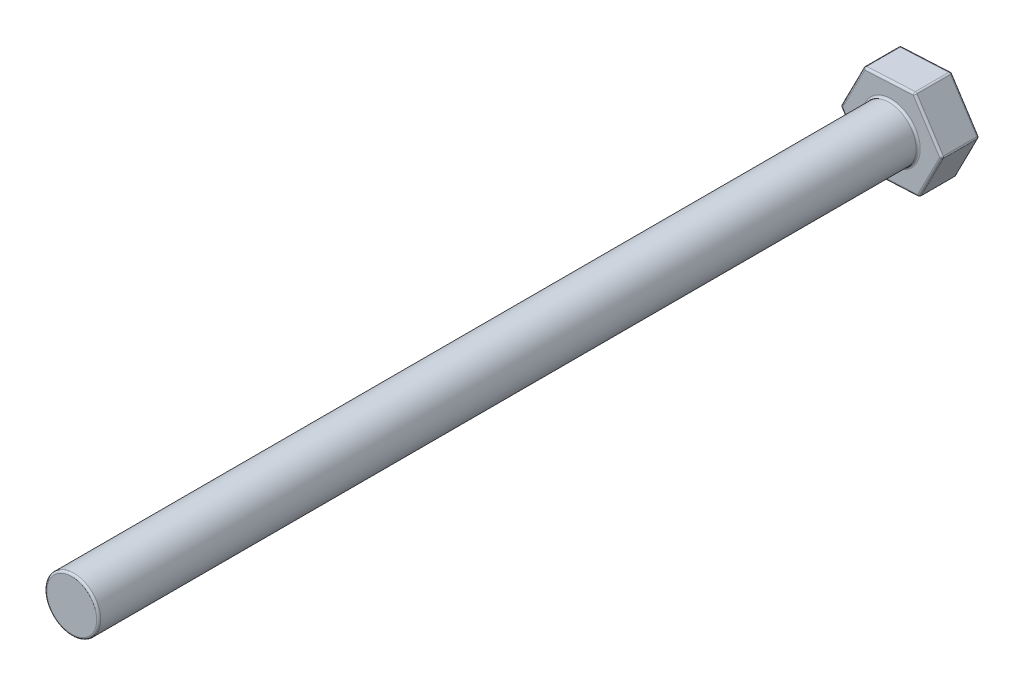
ISO-10303-21;
HEADER;
FILE_DESCRIPTION(('STEP AP214'),'2;1');
FILE_NAME('part.step','',(''),(''),'','','');
FILE_SCHEMA(('AUTOMOTIVE_DESIGN { 1 0 10303 214 1 1 1 1 }'));
ENDSEC;
DATA;
#1=APPLICATION_CONTEXT('core data for automotive mechanical design processes');
#2=APPLICATION_PROTOCOL_DEFINITION('international standard','automotive_design',2000,#1);
#3=PRODUCT_CONTEXT('',#1,'mechanical');
#4=PRODUCT('Part','Part','',(#3));
#5=PRODUCT_RELATED_PRODUCT_CATEGORY('part','',(#4));
#6=PRODUCT_DEFINITION_FORMATION('','',#4);
#7=PRODUCT_DEFINITION_CONTEXT('part definition',#1,'design');
#8=PRODUCT_DEFINITION('design','',#6,#7);
#9=PRODUCT_DEFINITION_SHAPE('','',#8);
#10=(LENGTH_UNIT() NAMED_UNIT(*) SI_UNIT(.MILLI.,.METRE.));
#11=(NAMED_UNIT(*) PLANE_ANGLE_UNIT() SI_UNIT($,.RADIAN.));
#12=(NAMED_UNIT(*) SI_UNIT($,.STERADIAN.) SOLID_ANGLE_UNIT());
#13=UNCERTAINTY_MEASURE_WITH_UNIT(LENGTH_MEASURE(1.E-05),#10,'distance_accuracy_value','');
#14=(GEOMETRIC_REPRESENTATION_CONTEXT(3) GLOBAL_UNCERTAINTY_ASSIGNED_CONTEXT((#13)) GLOBAL_UNIT_ASSIGNED_CONTEXT((#10,
#11,#12)) REPRESENTATION_CONTEXT('',''));
#15=CARTESIAN_POINT('',(0.,0.,0.));
#16=DIRECTION('',(0.,0.,1.));
#17=DIRECTION('',(1.,0.,0.));
#18=AXIS2_PLACEMENT_3D('',#15,#16,#17);
#19=CARTESIAN_POINT('',(0.,0.,120.));
#20=DIRECTION('',(0.,0.,-1.));
#21=DIRECTION('',(-1.,0.,0.));
#22=AXIS2_PLACEMENT_3D('',#19,#20,#21);
#23=CYLINDRICAL_SURFACE('',#22,3.95);
#24=CARTESIAN_POINT('',(0.,0.,0.299999999999995));
#25=DIRECTION('',(0.,0.,-1.));
#26=DIRECTION('',(-1.,0.,0.));
#27=AXIS2_PLACEMENT_3D('',#24,#25,#26);
#28=CIRCLE('',#27,3.95);
#29=CARTESIAN_POINT('',(-3.95,0.,0.299999999999995));
#30=VERTEX_POINT('',#29);
#31=EDGE_CURVE('E44',#30,#30,#28,.F.);
#32=ORIENTED_EDGE('',*,*,#31,.T.);
#33=EDGE_LOOP('',(#32));
#34=FACE_BOUND('',#33,.T.);
#35=CARTESIAN_POINT('',(0.,0.,119.7));
#36=DIRECTION('',(0.,0.,1.));
#37=DIRECTION('',(1.,0.,0.));
#38=AXIS2_PLACEMENT_3D('',#35,#36,#37);
#39=CIRCLE('',#38,3.95);
#40=CARTESIAN_POINT('',(3.95,0.,119.7));
#41=VERTEX_POINT('',#40);
#42=EDGE_CURVE('E273',#41,#41,#39,.F.);
#43=ORIENTED_EDGE('',*,*,#42,.T.);
#44=EDGE_LOOP('',(#43));
#45=FACE_BOUND('',#44,.T.);
#46=ADVANCED_FACE('F35',(#34,#45),#23,.T.);
#47=CARTESIAN_POINT('',(0.,0.,120.));
#48=DIRECTION('',(0.,0.,1.));
#49=DIRECTION('',(1.,0.,0.));
#50=AXIS2_PLACEMENT_3D('',#47,#48,#49);
#51=PLANE('',#50);
#52=CARTESIAN_POINT('',(0.,0.,120.));
#53=DIRECTION('',(0.,0.,1.));
#54=DIRECTION('',(1.,0.,0.));
#55=AXIS2_PLACEMENT_3D('',#52,#53,#54);
#56=CIRCLE('',#55,3.65);
#57=CARTESIAN_POINT('',(3.65,0.,120.));
#58=VERTEX_POINT('',#57);
#59=EDGE_CURVE('E11',#58,#58,#56,.T.);
#60=ORIENTED_EDGE('',*,*,#59,.T.);
#61=EDGE_LOOP('',(#60));
#62=FACE_BOUND('',#61,.T.);
#63=ADVANCED_FACE('F470',(#62),#51,.T.);
#64=CARTESIAN_POINT('',(3.39564795055581,6.62869330983763,-5.5));
#65=DIRECTION('',(-0.839851839228609,-0.542815703664073,0.));
#66=DIRECTION('',(0.542815703664073,-0.839851839228609,0.));
#67=AXIS2_PLACEMENT_3D('',#64,#65,#66);
#68=PLANE('',#67);
#69=DIRECTION('',(0.,0.,1.));
#70=VECTOR('',#69,1.);
#71=CARTESIAN_POINT('',(3.48966638834505,6.48322670420022,-5.5));
#72=LINE('',#71,#70);
#73=CARTESIAN_POINT('',(3.48966638834505,6.48322670420022,-5.2));
#74=VERTEX_POINT('',#73);
#75=CARTESIAN_POINT('',(3.48966638834505,6.48322670420022,-0.3));
#76=VERTEX_POINT('',#75);
#77=EDGE_CURVE('E224',#74,#76,#72,.T.);
#78=ORIENTED_EDGE('',*,*,#77,.T.);
#79=DIRECTION('',(0.542815703664073,-0.839851839228609,0.));
#80=VECTOR('',#79,1.);
#81=CARTESIAN_POINT('',(3.39564795055581,6.62869330983763,-0.3));
#82=LINE('',#81,#80);
#83=CARTESIAN_POINT('',(7.344422337704,0.519095873066327,-0.3));
#84=VERTEX_POINT('',#83);
#85=EDGE_CURVE('E229',#76,#84,#82,.T.);
#86=ORIENTED_EDGE('',*,*,#85,.T.);
#87=DIRECTION('',(0.,0.,1.));
#88=VECTOR('',#87,1.);
#89=CARTESIAN_POINT('',(7.344422337704,0.519095873066327,-5.5));
#90=LINE('',#89,#88);
#91=CARTESIAN_POINT('',(7.344422337704,0.519095873066327,-5.2));
#92=VERTEX_POINT('',#91);
#93=EDGE_CURVE('E226',#84,#92,#90,.F.);
#94=ORIENTED_EDGE('',*,*,#93,.T.);
#95=DIRECTION('',(0.542815703664073,-0.839851839228609,0.));
#96=VECTOR('',#95,1.);
#97=CARTESIAN_POINT('',(3.39564795055581,6.62869330983763,-5.2));
#98=LINE('',#97,#96);
#99=EDGE_CURVE('E222',#92,#74,#98,.F.);
#100=ORIENTED_EDGE('',*,*,#99,.T.);
#101=EDGE_LOOP('',(#78,#86,#94,#100));
#102=FACE_BOUND('',#101,.T.);
#103=ADVANCED_FACE('F388',(#102),#68,.F.);
#104=CARTESIAN_POINT('',(7.43844077549324,0.373629267428915,-5.5));
#105=DIRECTION('',(-0.890018108560518,0.455925176355023,0.));
#106=DIRECTION('',(-0.455925176355023,-0.890018108560518,0.));
#107=AXIS2_PLACEMENT_3D('',#104,#105,#106);
#108=PLANE('',#107);
#109=DIRECTION('',(0.,0.,1.));
#110=VECTOR('',#109,1.);
#111=CARTESIAN_POINT('',(7.35947221850357,0.219473609060598,-5.5));
#112=LINE('',#111,#110);
#113=CARTESIAN_POINT('',(7.35947221850357,0.219473609060598,-5.2));
#114=VERTEX_POINT('',#113);
#115=CARTESIAN_POINT('',(7.35947221850357,0.219473609060598,-0.3));
#116=VERTEX_POINT('',#115);
#117=EDGE_CURVE('E215',#114,#116,#112,.T.);
#118=ORIENTED_EDGE('',*,*,#117,.T.);
#119=DIRECTION('',(-0.455925176355023,-0.890018108560518,0.));
#120=VECTOR('',#119,1.);
#121=CARTESIAN_POINT('',(7.43844077549324,0.373629267428915,-0.3));
#122=LINE('',#121,#120);
#123=CARTESIAN_POINT('',(4.1217613819271,-6.10090838404039,-0.3));
#124=VERTEX_POINT('',#123);
#125=EDGE_CURVE('E220',#116,#124,#122,.T.);
#126=ORIENTED_EDGE('',*,*,#125,.T.);
#127=DIRECTION('',(0.,0.,1.));
#128=VECTOR('',#127,1.);
#129=CARTESIAN_POINT('',(4.1217613819271,-6.10090838404039,-5.5));
#130=LINE('',#129,#128);
#131=CARTESIAN_POINT('',(4.1217613819271,-6.10090838404039,-5.2));
#132=VERTEX_POINT('',#131);
#133=EDGE_CURVE('E217',#124,#132,#130,.F.);
#134=ORIENTED_EDGE('',*,*,#133,.T.);
#135=DIRECTION('',(-0.455925176355023,-0.890018108560518,0.));
#136=VECTOR('',#135,1.);
#137=CARTESIAN_POINT('',(7.43844077549324,0.373629267428915,-5.2));
#138=LINE('',#137,#136);
#139=EDGE_CURVE('E213',#132,#114,#138,.F.);
#140=ORIENTED_EDGE('',*,*,#139,.T.);
#141=EDGE_LOOP('',(#118,#126,#134,#140));
#142=FACE_BOUND('',#141,.T.);
#143=ADVANCED_FACE('F789',(#142),#108,.F.);
#144=CARTESIAN_POINT('',(4.04279282493743,-6.25506404240871,-5.5));
#145=DIRECTION('',(-0.0501662693319089,0.998740880019096,0.));
#146=DIRECTION('',(-0.998740880019096,-0.0501662693319089,0.));
#147=AXIS2_PLACEMENT_3D('',#144,#145,#146);
#148=PLANE('',#147);
#149=DIRECTION('',(0.,0.,1.));
#150=VECTOR('',#149,1.);
#151=CARTESIAN_POINT('',(3.86980583015852,-6.26375309513962,-5.5));
#152=LINE('',#151,#150);
#153=CARTESIAN_POINT('',(3.86980583015852,-6.26375309513962,-5.2));
#154=VERTEX_POINT('',#153);
#155=CARTESIAN_POINT('',(3.86980583015852,-6.26375309513962,-0.3));
#156=VERTEX_POINT('',#155);
#157=EDGE_CURVE('E206',#154,#156,#152,.T.);
#158=ORIENTED_EDGE('',*,*,#157,.T.);
#159=DIRECTION('',(-0.998740880019096,-0.0501662693319089,0.));
#160=VECTOR('',#159,1.);
#161=CARTESIAN_POINT('',(4.04279282493743,-6.25506404240871,-0.3));
#162=LINE('',#161,#160);
#163=CARTESIAN_POINT('',(-3.2226609557769,-6.62000425710672,-0.3));
#164=VERTEX_POINT('',#163);
#165=EDGE_CURVE('E211',#156,#164,#162,.T.);
#166=ORIENTED_EDGE('',*,*,#165,.T.);
#167=DIRECTION('',(0.,0.,1.));
#168=VECTOR('',#167,1.);
#169=CARTESIAN_POINT('',(-3.2226609557769,-6.62000425710672,-5.5));
#170=LINE('',#169,#168);
#171=CARTESIAN_POINT('',(-3.2226609557769,-6.62000425710672,-5.2));
#172=VERTEX_POINT('',#171);
#173=EDGE_CURVE('E208',#164,#172,#170,.F.);
#174=ORIENTED_EDGE('',*,*,#173,.T.);
#175=DIRECTION('',(-0.998740880019096,-0.0501662693319089,0.));
#176=VECTOR('',#175,1.);
#177=CARTESIAN_POINT('',(4.04279282493744,-6.25506404240871,-5.2));
#178=LINE('',#177,#176);
#179=EDGE_CURVE('E204',#172,#154,#178,.F.);
#180=ORIENTED_EDGE('',*,*,#179,.T.);
#181=EDGE_LOOP('',(#158,#166,#174,#180));
#182=FACE_BOUND('',#181,.T.);
#183=ADVANCED_FACE('F781',(#182),#148,.F.);
#184=CARTESIAN_POINT('',(-3.39564795055581,-6.62869330983763,-5.5));
#185=DIRECTION('',(0.839851839228609,0.542815703664073,0.));
#186=DIRECTION('',(-0.542815703664073,0.839851839228609,0.));
#187=AXIS2_PLACEMENT_3D('',#184,#185,#186);
#188=PLANE('',#187);
#189=DIRECTION('',(0.,0.,1.));
#190=VECTOR('',#189,1.);
#191=CARTESIAN_POINT('',(-3.48966638834505,-6.48322670420022,-5.5));
#192=LINE('',#191,#190);
#193=CARTESIAN_POINT('',(-3.48966638834505,-6.48322670420022,-5.2));
#194=VERTEX_POINT('',#193);
#195=CARTESIAN_POINT('',(-3.48966638834505,-6.48322670420022,-0.3));
#196=VERTEX_POINT('',#195);
#197=EDGE_CURVE('E172',#194,#196,#192,.T.);
#198=ORIENTED_EDGE('',*,*,#197,.T.);
#199=DIRECTION('',(-0.542815703664073,0.839851839228609,0.));
#200=VECTOR('',#199,1.);
#201=CARTESIAN_POINT('',(-3.39564795055581,-6.62869330983763,-0.3));
#202=LINE('',#201,#200);
#203=CARTESIAN_POINT('',(-7.344422337704,-0.519095873066328,-0.3));
#204=VERTEX_POINT('',#203);
#205=EDGE_CURVE('E168',#196,#204,#202,.T.);
#206=ORIENTED_EDGE('',*,*,#205,.T.);
#207=DIRECTION('',(0.,0.,1.));
#208=VECTOR('',#207,1.);
#209=CARTESIAN_POINT('',(-7.344422337704,-0.519095873066328,-5.5));
#210=LINE('',#209,#208);
#211=CARTESIAN_POINT('',(-7.344422337704,-0.519095873066328,-5.2));
#212=VERTEX_POINT('',#211);
#213=EDGE_CURVE('E160',#204,#212,#210,.F.);
#214=ORIENTED_EDGE('',*,*,#213,.T.);
#215=DIRECTION('',(-0.542815703664073,0.839851839228609,0.));
#216=VECTOR('',#215,1.);
#217=CARTESIAN_POINT('',(-3.39564795055581,-6.62869330983763,-5.2));
#218=LINE('',#217,#216);
#219=EDGE_CURVE('E165',#212,#194,#218,.F.);
#220=ORIENTED_EDGE('',*,*,#219,.T.);
#221=EDGE_LOOP('',(#198,#206,#214,#220));
#222=FACE_BOUND('',#221,.T.);
#223=ADVANCED_FACE('F163',(#222),#188,.F.);
#224=CARTESIAN_POINT('',(-7.43844077549324,-0.373629267428917,-5.5));
#225=DIRECTION('',(0.890018108560518,-0.455925176355023,0.));
#226=DIRECTION('',(0.455925176355023,0.890018108560518,0.));
#227=AXIS2_PLACEMENT_3D('',#224,#225,#226);
#228=PLANE('',#227);
#229=DIRECTION('',(0.,0.,1.));
#230=VECTOR('',#229,1.);
#231=CARTESIAN_POINT('',(-7.35947221850357,-0.219473609060599,-5.5));
#232=LINE('',#231,#230);
#233=CARTESIAN_POINT('',(-7.35947221850357,-0.2194736090606,-5.2));
#234=VERTEX_POINT('',#233);
#235=CARTESIAN_POINT('',(-7.35947221850357,-0.219473609060599,-0.3));
#236=VERTEX_POINT('',#235);
#237=EDGE_CURVE('E180',#234,#236,#232,.T.);
#238=ORIENTED_EDGE('',*,*,#237,.T.);
#239=DIRECTION('',(0.455925176355023,0.890018108560518,0.));
#240=VECTOR('',#239,1.);
#241=CARTESIAN_POINT('',(-7.43844077549324,-0.373629267428917,-0.3));
#242=LINE('',#241,#240);
#243=CARTESIAN_POINT('',(-4.1217613819271,6.10090838404039,-0.3));
#244=VERTEX_POINT('',#243);
#245=EDGE_CURVE('E245',#236,#244,#242,.T.);
#246=ORIENTED_EDGE('',*,*,#245,.T.);
#247=DIRECTION('',(0.,0.,1.));
#248=VECTOR('',#247,1.);
#249=CARTESIAN_POINT('',(-4.1217613819271,6.10090838404039,-5.5));
#250=LINE('',#249,#248);
#251=CARTESIAN_POINT('',(-4.1217613819271,6.10090838404039,-5.2));
#252=VERTEX_POINT('',#251);
#253=EDGE_CURVE('E242',#244,#252,#250,.F.);
#254=ORIENTED_EDGE('',*,*,#253,.T.);
#255=DIRECTION('',(0.455925176355023,0.890018108560518,0.));
#256=VECTOR('',#255,1.);
#257=CARTESIAN_POINT('',(-7.43844077549324,-0.373629267428917,-5.2));
#258=LINE('',#257,#256);
#259=EDGE_CURVE('E240',#252,#234,#258,.F.);
#260=ORIENTED_EDGE('',*,*,#259,.T.);
#261=EDGE_LOOP('',(#238,#246,#254,#260));
#262=FACE_BOUND('',#261,.T.);
#263=ADVANCED_FACE('F447',(#262),#228,.F.);
#264=CARTESIAN_POINT('',(-4.04279282493743,6.25506404240871,-5.5));
#265=DIRECTION('',(0.0501662693319089,-0.998740880019096,0.));
#266=DIRECTION('',(0.998740880019096,0.0501662693319089,0.));
#267=AXIS2_PLACEMENT_3D('',#264,#265,#266);
#268=PLANE('',#267);
#269=DIRECTION('',(0.,0.,1.));
#270=VECTOR('',#269,1.);
#271=CARTESIAN_POINT('',(-3.86980583015852,6.26375309513962,-5.5));
#272=LINE('',#271,#270);
#273=CARTESIAN_POINT('',(-3.86980583015852,6.26375309513962,-5.2));
#274=VERTEX_POINT('',#273);
#275=CARTESIAN_POINT('',(-3.86980583015852,6.26375309513962,-0.3));
#276=VERTEX_POINT('',#275);
#277=EDGE_CURVE('E233',#274,#276,#272,.T.);
#278=ORIENTED_EDGE('',*,*,#277,.T.);
#279=DIRECTION('',(0.998740880019096,0.0501662693319089,0.));
#280=VECTOR('',#279,1.);
#281=CARTESIAN_POINT('',(-4.04279282493743,6.25506404240871,-0.3));
#282=LINE('',#281,#280);
#283=CARTESIAN_POINT('',(3.2226609557769,6.62000425710672,-0.3));
#284=VERTEX_POINT('',#283);
#285=EDGE_CURVE('E238',#276,#284,#282,.T.);
#286=ORIENTED_EDGE('',*,*,#285,.T.);
#287=DIRECTION('',(0.,0.,1.));
#288=VECTOR('',#287,1.);
#289=CARTESIAN_POINT('',(3.2226609557769,6.62000425710672,-5.5));
#290=LINE('',#289,#288);
#291=CARTESIAN_POINT('',(3.2226609557769,6.62000425710672,-5.2));
#292=VERTEX_POINT('',#291);
#293=EDGE_CURVE('E235',#284,#292,#290,.F.);
#294=ORIENTED_EDGE('',*,*,#293,.T.);
#295=DIRECTION('',(0.998740880019096,0.0501662693319089,0.));
#296=VECTOR('',#295,1.);
#297=CARTESIAN_POINT('',(-4.04279282493744,6.25506404240871,-5.2));
#298=LINE('',#297,#296);
#299=EDGE_CURVE('E231',#292,#274,#298,.F.);
#300=ORIENTED_EDGE('',*,*,#299,.T.);
#301=EDGE_LOOP('',(#278,#286,#294,#300));
#302=FACE_BOUND('',#301,.T.);
#303=ADVANCED_FACE('F459',(#302),#268,.F.);
#304=CARTESIAN_POINT('',(0.,0.,-5.5));
#305=DIRECTION('',(0.,0.,-1.));
#306=DIRECTION('',(-1.,0.,0.));
#307=AXIS2_PLACEMENT_3D('',#304,#305,#306);
#308=PLANE('',#307);
#309=DIRECTION('',(0.455925176355023,0.890018108560518,0.));
#310=VECTOR('',#309,1.);
#311=CARTESIAN_POINT('',(-3.77578739236928,6.1182864895022,-5.5));
#312=LINE('',#311,#310);
#313=CARTESIAN_POINT('',(-7.09246678593542,-0.356251161967106,-5.5));
#314=VERTEX_POINT('',#313);
#315=CARTESIAN_POINT('',(-3.85475594935895,5.96413083113389,-5.5));
#316=VERTEX_POINT('',#315);
#317=EDGE_CURVE('E52',#314,#316,#312,.T.);
#318=ORIENTED_EDGE('',*,*,#317,.T.);
#319=DIRECTION('',(0.998740880019096,0.0501662693319089,0.));
#320=VECTOR('',#319,1.);
#321=CARTESIAN_POINT('',(3.41069783135538,6.3290710458319,-5.5));
#322=LINE('',#321,#320);
#323=CARTESIAN_POINT('',(3.23771083657647,6.32038199310099,-5.5));
#324=VERTEX_POINT('',#323);
#325=EDGE_CURVE('E271',#316,#324,#322,.T.);
#326=ORIENTED_EDGE('',*,*,#325,.T.);
#327=DIRECTION('',(0.542815703664073,-0.839851839228609,0.));
#328=VECTOR('',#327,1.);
#329=CARTESIAN_POINT('',(7.18648522372466,0.210784556329693,-5.5));
#330=LINE('',#329,#328);
#331=CARTESIAN_POINT('',(7.09246678593542,0.356251161967106,-5.5));
#332=VERTEX_POINT('',#331);
#333=EDGE_CURVE('E263',#324,#332,#330,.T.);
#334=ORIENTED_EDGE('',*,*,#333,.T.);
#335=DIRECTION('',(-0.455925176355023,-0.890018108560518,0.));
#336=VECTOR('',#335,1.);
#337=CARTESIAN_POINT('',(3.77578739236928,-6.11828648950221,-5.5));
#338=LINE('',#337,#336);
#339=CARTESIAN_POINT('',(3.85475594935895,-5.96413083113389,-5.5));
#340=VERTEX_POINT('',#339);
#341=EDGE_CURVE('E265',#332,#340,#338,.T.);
#342=ORIENTED_EDGE('',*,*,#341,.T.);
#343=DIRECTION('',(-0.998740880019096,-0.0501662693319089,0.));
#344=VECTOR('',#343,1.);
#345=CARTESIAN_POINT('',(-3.41069783135538,-6.3290710458319,-5.5));
#346=LINE('',#345,#344);
#347=CARTESIAN_POINT('',(-3.23771083657647,-6.32038199310099,-5.5));
#348=VERTEX_POINT('',#347);
#349=EDGE_CURVE('E267',#340,#348,#346,.T.);
#350=ORIENTED_EDGE('',*,*,#349,.T.);
#351=DIRECTION('',(-0.542815703664073,0.839851839228609,0.));
#352=VECTOR('',#351,1.);
#353=CARTESIAN_POINT('',(-7.18648522372466,-0.210784556329694,-5.5));
#354=LINE('',#353,#352);
#355=EDGE_CURVE('E57',#348,#314,#354,.T.);
#356=ORIENTED_EDGE('',*,*,#355,.T.);
#357=EDGE_LOOP('',(#318,#326,#334,#342,#350,#356));
#358=FACE_BOUND('',#357,.T.);
#359=ADVANCED_FACE('F410',(#358),#308,.T.);
#360=CARTESIAN_POINT('',(0.,0.,0.));
#361=DIRECTION('',(0.,0.,-1.));
#362=DIRECTION('',(-1.,0.,0.));
#363=AXIS2_PLACEMENT_3D('',#360,#361,#362);
#364=PLANE('',#363);
#365=DIRECTION('',(-0.998740880019096,-0.0501662693319089,0.));
#366=VECTOR('',#365,1.);
#367=CARTESIAN_POINT('',(0.30852255639124,-6.14225641211744,0.));
#368=LINE('',#367,#366);
#369=CARTESIAN_POINT('',(-3.23771083657647,-6.320381993101,0.));
#370=VERTEX_POINT('',#369);
#371=CARTESIAN_POINT('',(3.85475594935895,-5.96413083113389,0.));
#372=VERTEX_POINT('',#371);
#373=EDGE_CURVE('E258',#370,#372,#368,.F.);
#374=ORIENTED_EDGE('',*,*,#373,.T.);
#375=DIRECTION('',(-0.455925176355023,-0.890018108560518,0.));
#376=VECTOR('',#375,1.);
#377=CARTESIAN_POINT('',(5.47361136764718,-2.80393983458339,0.));
#378=LINE('',#377,#376);
#379=CARTESIAN_POINT('',(7.09246678593542,0.356251161967106,0.));
#380=VERTEX_POINT('',#379);
#381=EDGE_CURVE('E260',#372,#380,#378,.F.);
#382=ORIENTED_EDGE('',*,*,#381,.T.);
#383=DIRECTION('',(0.542815703664073,-0.839851839228609,0.));
#384=VECTOR('',#383,1.);
#385=CARTESIAN_POINT('',(5.16508881125594,3.33831657753405,0.));
#386=LINE('',#385,#384);
#387=CARTESIAN_POINT('',(3.23771083657647,6.320381993101,0.));
#388=VERTEX_POINT('',#387);
#389=EDGE_CURVE('E250',#380,#388,#386,.F.);
#390=ORIENTED_EDGE('',*,*,#389,.T.);
#391=DIRECTION('',(0.998740880019096,0.0501662693319089,0.));
#392=VECTOR('',#391,1.);
#393=CARTESIAN_POINT('',(-0.30852255639124,6.14225641211744,0.));
#394=LINE('',#393,#392);
#395=CARTESIAN_POINT('',(-3.85475594935895,5.96413083113389,0.));
#396=VERTEX_POINT('',#395);
#397=EDGE_CURVE('E252',#388,#396,#394,.F.);
#398=ORIENTED_EDGE('',*,*,#397,.T.);
#399=DIRECTION('',(0.455925176355023,0.890018108560518,0.));
#400=VECTOR('',#399,1.);
#401=CARTESIAN_POINT('',(-5.47361136764718,2.80393983458339,0.));
#402=LINE('',#401,#400);
#403=CARTESIAN_POINT('',(-7.09246678593542,-0.356251161967107,0.));
#404=VERTEX_POINT('',#403);
#405=EDGE_CURVE('E254',#396,#404,#402,.F.);
#406=ORIENTED_EDGE('',*,*,#405,.T.);
#407=DIRECTION('',(-0.542815703664073,0.839851839228609,0.));
#408=VECTOR('',#407,1.);
#409=CARTESIAN_POINT('',(-5.16508881125594,-3.33831657753405,0.));
#410=LINE('',#409,#408);
#411=EDGE_CURVE('E256',#404,#370,#410,.F.);
#412=ORIENTED_EDGE('',*,*,#411,.T.);
#413=EDGE_LOOP('',(#374,#382,#390,#398,#406,#412));
#414=FACE_BOUND('',#413,.T.);
#415=CARTESIAN_POINT('',(0.,0.,0.));
#416=DIRECTION('',(0.,0.,-1.));
#417=DIRECTION('',(-1.,0.,0.));
#418=AXIS2_PLACEMENT_3D('',#415,#416,#417);
#419=CIRCLE('',#418,4.25);
#420=CARTESIAN_POINT('',(-4.25,0.,0.));
#421=VERTEX_POINT('',#420);
#422=EDGE_CURVE('E247',#421,#421,#419,.T.);
#423=ORIENTED_EDGE('',*,*,#422,.T.);
#424=EDGE_LOOP('',(#423));
#425=FACE_BOUND('',#424,.T.);
#426=ADVANCED_FACE('F377',(#414,#425),#364,.F.);
#427=CARTESIAN_POINT('',(3.23771083657647,6.320381993101,-5.5));
#428=DIRECTION('',(0.,0.,1.));
#429=DIRECTION('',(1.,0.,0.));
#430=AXIS2_PLACEMENT_3D('',#427,#428,#429);
#431=CYLINDRICAL_SURFACE('',#430,0.3);
#432=CARTESIAN_POINT('',(3.23771083657647,6.320381993101,-5.2));
#433=DIRECTION('',(0.,0.,-1.));
#434=DIRECTION('',(-1.,0.,0.));
#435=AXIS2_PLACEMENT_3D('',#432,#433,#434);
#436=CIRCLE('',#435,0.3);
#437=EDGE_CURVE('E39',#292,#74,#436,.T.);
#438=ORIENTED_EDGE('',*,*,#437,.F.);
#439=ORIENTED_EDGE('',*,*,#293,.F.);
#440=CARTESIAN_POINT('',(3.23771083657647,6.320381993101,-0.3));
#441=DIRECTION('',(0.,0.,1.));
#442=DIRECTION('',(1.,0.,0.));
#443=AXIS2_PLACEMENT_3D('',#440,#441,#442);
#444=CIRCLE('',#443,0.3);
#445=EDGE_CURVE('E200',#76,#284,#444,.T.);
#446=ORIENTED_EDGE('',*,*,#445,.F.);
#447=ORIENTED_EDGE('',*,*,#77,.F.);
#448=EDGE_LOOP('',(#438,#439,#446,#447));
#449=FACE_BOUND('',#448,.T.);
#450=ADVANCED_FACE('F403',(#449),#431,.T.);
#451=CARTESIAN_POINT('',(3.23771083657647,6.320381993101,-5.2));
#452=DIRECTION('',(0.,0.,1.));
#453=DIRECTION('',(1.,0.,0.));
#454=AXIS2_PLACEMENT_3D('',#451,#452,#453);
#455=SPHERICAL_SURFACE('',#454,0.3);
#456=CARTESIAN_POINT('',(3.23771083657647,6.32038199310099,-5.2));
#457=DIRECTION('',(0.998740880019096,0.0501662693319115,0.));
#458=DIRECTION('',(-0.0501662693319116,0.998740880019096,0.));
#459=AXIS2_PLACEMENT_3D('',#456,#457,#458);
#460=CIRCLE('',#459,0.3);
#461=EDGE_CURVE('E354',#292,#324,#460,.F.);
#462=ORIENTED_EDGE('',*,*,#461,.F.);
#463=ORIENTED_EDGE('',*,*,#437,.T.);
#464=CARTESIAN_POINT('',(3.23771083657647,6.320381993101,-5.2));
#465=DIRECTION('',(-0.542815703664073,0.839851839228609,0.));
#466=DIRECTION('',(-0.839851839228609,-0.542815703664073,0.));
#467=AXIS2_PLACEMENT_3D('',#464,#465,#466);
#468=CIRCLE('',#467,0.3);
#469=EDGE_CURVE('E357',#324,#74,#468,.F.);
#470=ORIENTED_EDGE('',*,*,#469,.F.);
#471=EDGE_LOOP('',(#462,#463,#470));
#472=FACE_BOUND('',#471,.T.);
#473=ADVANCED_FACE('F406',(#472),#455,.T.);
#474=CARTESIAN_POINT('',(3.23771083657647,6.320381993101,-0.3));
#475=DIRECTION('',(0.,0.,1.));
#476=DIRECTION('',(1.,0.,0.));
#477=AXIS2_PLACEMENT_3D('',#474,#475,#476);
#478=SPHERICAL_SURFACE('',#477,0.3);
#479=CARTESIAN_POINT('',(3.23771083657647,6.320381993101,-0.3));
#480=DIRECTION('',(-0.542815703664073,0.839851839228609,0.));
#481=DIRECTION('',(-0.839851839228609,-0.542815703664073,0.));
#482=AXIS2_PLACEMENT_3D('',#479,#480,#481);
#483=CIRCLE('',#482,0.3);
#484=EDGE_CURVE('E348',#76,#388,#483,.F.);
#485=ORIENTED_EDGE('',*,*,#484,.F.);
#486=ORIENTED_EDGE('',*,*,#445,.T.);
#487=CARTESIAN_POINT('',(3.23771083657647,6.320381993101,-0.3));
#488=DIRECTION('',(0.998740880019096,0.0501662693319088,0.));
#489=DIRECTION('',(-0.0501662693319088,0.998740880019096,0.));
#490=AXIS2_PLACEMENT_3D('',#487,#488,#489);
#491=CIRCLE('',#490,0.3);
#492=EDGE_CURVE('E351',#388,#284,#491,.F.);
#493=ORIENTED_EDGE('',*,*,#492,.F.);
#494=EDGE_LOOP('',(#485,#486,#493));
#495=FACE_BOUND('',#494,.T.);
#496=ADVANCED_FACE('F364',(#495),#478,.T.);
#497=CARTESIAN_POINT('',(5.16508881125594,3.33831657753405,-5.2));
#498=DIRECTION('',(-0.542815703664073,0.839851839228609,0.));
#499=DIRECTION('',(-0.839851839228609,-0.542815703664073,0.));
#500=AXIS2_PLACEMENT_3D('',#497,#498,#499);
#501=CYLINDRICAL_SURFACE('',#500,0.3);
#502=ORIENTED_EDGE('',*,*,#469,.T.);
#503=ORIENTED_EDGE('',*,*,#99,.F.);
#504=CARTESIAN_POINT('',(7.09246678593542,0.356251161967106,-5.2));
#505=DIRECTION('',(0.542815703664071,-0.839851839228611,0.));
#506=DIRECTION('',(0.839851839228611,0.542815703664071,0.));
#507=AXIS2_PLACEMENT_3D('',#504,#505,#506);
#508=CIRCLE('',#507,0.3);
#509=EDGE_CURVE('E343',#332,#92,#508,.T.);
#510=ORIENTED_EDGE('',*,*,#509,.F.);
#511=ORIENTED_EDGE('',*,*,#333,.F.);
#512=EDGE_LOOP('',(#502,#503,#510,#511));
#513=FACE_BOUND('',#512,.T.);
#514=ADVANCED_FACE('F400',(#513),#501,.T.);
#515=CARTESIAN_POINT('',(-0.30852255639124,6.14225641211744,-5.2));
#516=DIRECTION('',(-0.998740880019096,-0.0501662693319089,0.));
#517=DIRECTION('',(0.0501662693319089,-0.998740880019096,0.));
#518=AXIS2_PLACEMENT_3D('',#515,#516,#517);
#519=CYLINDRICAL_SURFACE('',#518,0.3);
#520=ORIENTED_EDGE('',*,*,#461,.T.);
#521=ORIENTED_EDGE('',*,*,#325,.F.);
#522=CARTESIAN_POINT('',(-3.85475594935895,5.96413083113389,-5.2));
#523=DIRECTION('',(-0.998740880019096,-0.0501662693319088,0.));
#524=DIRECTION('',(0.0501662693319088,-0.998740880019096,0.));
#525=AXIS2_PLACEMENT_3D('',#522,#523,#524);
#526=CIRCLE('',#525,0.3);
#527=EDGE_CURVE('E340',#274,#316,#526,.T.);
#528=ORIENTED_EDGE('',*,*,#527,.F.);
#529=ORIENTED_EDGE('',*,*,#299,.F.);
#530=EDGE_LOOP('',(#520,#521,#528,#529));
#531=FACE_BOUND('',#530,.T.);
#532=ADVANCED_FACE('F408',(#531),#519,.T.);
#533=CARTESIAN_POINT('',(-3.85475594935895,5.96413083113389,-5.5));
#534=DIRECTION('',(0.,0.,1.));
#535=DIRECTION('',(1.,0.,0.));
#536=AXIS2_PLACEMENT_3D('',#533,#534,#535);
#537=CYLINDRICAL_SURFACE('',#536,0.3);
#538=CARTESIAN_POINT('',(-3.85475594935895,5.96413083113389,-0.3));
#539=DIRECTION('',(0.,0.,1.));
#540=DIRECTION('',(1.,0.,0.));
#541=AXIS2_PLACEMENT_3D('',#538,#539,#540);
#542=CIRCLE('',#541,0.3);
#543=EDGE_CURVE('E334',#276,#244,#542,.T.);
#544=ORIENTED_EDGE('',*,*,#543,.F.);
#545=ORIENTED_EDGE('',*,*,#277,.F.);
#546=CARTESIAN_POINT('',(-3.85475594935895,5.96413083113389,-5.2));
#547=DIRECTION('',(0.,0.,-1.));
#548=DIRECTION('',(-1.,0.,0.));
#549=AXIS2_PLACEMENT_3D('',#546,#547,#548);
#550=CIRCLE('',#549,0.3);
#551=EDGE_CURVE('E337',#252,#274,#550,.T.);
#552=ORIENTED_EDGE('',*,*,#551,.F.);
#553=ORIENTED_EDGE('',*,*,#253,.F.);
#554=EDGE_LOOP('',(#544,#545,#552,#553));
#555=FACE_BOUND('',#554,.T.);
#556=ADVANCED_FACE('F457',(#555),#537,.T.);
#557=CARTESIAN_POINT('',(-4.02774294413786,5.95544177840298,-0.3));
#558=DIRECTION('',(0.998740880019096,0.0501662693319089,0.));
#559=DIRECTION('',(-0.0501662693319089,0.998740880019096,0.));
#560=AXIS2_PLACEMENT_3D('',#557,#558,#559);
#561=CYLINDRICAL_SURFACE('',#560,0.3);
#562=ORIENTED_EDGE('',*,*,#492,.T.);
#563=ORIENTED_EDGE('',*,*,#285,.F.);
#564=CARTESIAN_POINT('',(-3.85475594935895,5.96413083113389,-0.3));
#565=DIRECTION('',(-0.998740880019096,-0.0501662693319088,0.));
#566=DIRECTION('',(0.0501662693319088,-0.998740880019096,0.));
#567=AXIS2_PLACEMENT_3D('',#564,#565,#566);
#568=CIRCLE('',#567,0.3);
#569=EDGE_CURVE('E331',#396,#276,#568,.T.);
#570=ORIENTED_EDGE('',*,*,#569,.F.);
#571=ORIENTED_EDGE('',*,*,#397,.F.);
#572=EDGE_LOOP('',(#562,#563,#570,#571));
#573=FACE_BOUND('',#572,.T.);
#574=ADVANCED_FACE('F372',(#573),#561,.T.);
#575=CARTESIAN_POINT('',(3.14369239878723,6.46584859873841,-0.3));
#576=DIRECTION('',(0.542815703664073,-0.839851839228609,0.));
#577=DIRECTION('',(0.839851839228609,0.542815703664073,0.));
#578=AXIS2_PLACEMENT_3D('',#575,#576,#577);
#579=CYLINDRICAL_SURFACE('',#578,0.3);
#580=ORIENTED_EDGE('',*,*,#484,.T.);
#581=ORIENTED_EDGE('',*,*,#389,.F.);
#582=CARTESIAN_POINT('',(7.09246678593542,0.356251161967105,-0.3));
#583=DIRECTION('',(0.542815703664073,-0.839851839228609,0.));
#584=DIRECTION('',(0.839851839228609,0.542815703664073,0.));
#585=AXIS2_PLACEMENT_3D('',#582,#583,#584);
#586=CIRCLE('',#585,0.3);
#587=EDGE_CURVE('E328',#84,#380,#586,.T.);
#588=ORIENTED_EDGE('',*,*,#587,.F.);
#589=ORIENTED_EDGE('',*,*,#85,.F.);
#590=EDGE_LOOP('',(#580,#581,#588,#589));
#591=FACE_BOUND('',#590,.T.);
#592=ADVANCED_FACE('F385',(#591),#579,.T.);
#593=CARTESIAN_POINT('',(7.09246678593542,0.356251161967105,-5.5));
#594=DIRECTION('',(0.,0.,1.));
#595=DIRECTION('',(1.,0.,0.));
#596=AXIS2_PLACEMENT_3D('',#593,#594,#595);
#597=CYLINDRICAL_SURFACE('',#596,0.3);
#598=CARTESIAN_POINT('',(7.09246678593542,0.356251161967105,-5.2));
#599=DIRECTION('',(0.,0.,-1.));
#600=DIRECTION('',(-1.,0.,0.));
#601=AXIS2_PLACEMENT_3D('',#598,#599,#600);
#602=CIRCLE('',#601,0.3);
#603=EDGE_CURVE('E345',#92,#114,#602,.T.);
#604=ORIENTED_EDGE('',*,*,#603,.F.);
#605=ORIENTED_EDGE('',*,*,#93,.F.);
#606=CARTESIAN_POINT('',(7.09246678593542,0.356251161967105,-0.3));
#607=DIRECTION('',(0.,0.,1.));
#608=DIRECTION('',(1.,0.,0.));
#609=AXIS2_PLACEMENT_3D('',#606,#607,#608);
#610=CIRCLE('',#609,0.3);
#611=EDGE_CURVE('E325',#116,#84,#610,.T.);
#612=ORIENTED_EDGE('',*,*,#611,.F.);
#613=ORIENTED_EDGE('',*,*,#117,.F.);
#614=EDGE_LOOP('',(#604,#605,#612,#613));
#615=FACE_BOUND('',#614,.T.);
#616=ADVANCED_FACE('F392',(#615),#597,.T.);
#617=CARTESIAN_POINT('',(7.09246678593542,0.356251161967106,-5.2));
#618=DIRECTION('',(0.,0.,1.));
#619=DIRECTION('',(1.,0.,0.));
#620=AXIS2_PLACEMENT_3D('',#617,#618,#619);
#621=SPHERICAL_SURFACE('',#620,0.3);
#622=ORIENTED_EDGE('',*,*,#509,.T.);
#623=ORIENTED_EDGE('',*,*,#603,.T.);
#624=CARTESIAN_POINT('',(7.09246678593542,0.356251161967105,-5.2));
#625=DIRECTION('',(0.455925176355022,0.890018108560518,0.));
#626=DIRECTION('',(-0.890018108560518,0.455925176355022,0.));
#627=AXIS2_PLACEMENT_3D('',#624,#625,#626);
#628=CIRCLE('',#627,0.3);
#629=EDGE_CURVE('E322',#332,#114,#628,.F.);
#630=ORIENTED_EDGE('',*,*,#629,.F.);
#631=EDGE_LOOP('',(#622,#623,#630));
#632=FACE_BOUND('',#631,.T.);
#633=ADVANCED_FACE('F534',(#632),#621,.T.);
#634=CARTESIAN_POINT('',(-3.85475594935895,5.96413083113389,-5.2));
#635=DIRECTION('',(0.,0.,1.));
#636=DIRECTION('',(1.,0.,0.));
#637=AXIS2_PLACEMENT_3D('',#634,#635,#636);
#638=SPHERICAL_SURFACE('',#637,0.3);
#639=ORIENTED_EDGE('',*,*,#551,.T.);
#640=ORIENTED_EDGE('',*,*,#527,.T.);
#641=CARTESIAN_POINT('',(-3.85475594935895,5.96413083113389,-5.2));
#642=DIRECTION('',(0.455925176355026,0.890018108560516,0.));
#643=DIRECTION('',(-0.890018108560516,0.455925176355026,0.));
#644=AXIS2_PLACEMENT_3D('',#641,#642,#643);
#645=CIRCLE('',#644,0.3);
#646=EDGE_CURVE('E319',#252,#316,#645,.F.);
#647=ORIENTED_EDGE('',*,*,#646,.F.);
#648=EDGE_LOOP('',(#639,#640,#647));
#649=FACE_BOUND('',#648,.T.);
#650=ADVANCED_FACE('F454',(#649),#638,.T.);
#651=CARTESIAN_POINT('',(-3.85475594935895,5.96413083113389,-0.3));
#652=DIRECTION('',(0.,0.,1.));
#653=DIRECTION('',(1.,0.,0.));
#654=AXIS2_PLACEMENT_3D('',#651,#652,#653);
#655=SPHERICAL_SURFACE('',#654,0.3);
#656=ORIENTED_EDGE('',*,*,#569,.T.);
#657=ORIENTED_EDGE('',*,*,#543,.T.);
#658=CARTESIAN_POINT('',(-3.85475594935895,5.96413083113389,-0.3));
#659=DIRECTION('',(0.455925176355022,0.890018108560518,0.));
#660=DIRECTION('',(-0.890018108560518,0.455925176355022,0.));
#661=AXIS2_PLACEMENT_3D('',#658,#659,#660);
#662=CIRCLE('',#661,0.3);
#663=EDGE_CURVE('E316',#396,#244,#662,.F.);
#664=ORIENTED_EDGE('',*,*,#663,.F.);
#665=EDGE_LOOP('',(#656,#657,#664));
#666=FACE_BOUND('',#665,.T.);
#667=ADVANCED_FACE('F527',(#666),#655,.T.);
#668=CARTESIAN_POINT('',(7.09246678593542,0.356251161967106,-0.3));
#669=DIRECTION('',(0.,0.,1.));
#670=DIRECTION('',(1.,0.,0.));
#671=AXIS2_PLACEMENT_3D('',#668,#669,#670);
#672=SPHERICAL_SURFACE('',#671,0.3);
#673=ORIENTED_EDGE('',*,*,#611,.T.);
#674=ORIENTED_EDGE('',*,*,#587,.T.);
#675=CARTESIAN_POINT('',(7.09246678593542,0.356251161967106,-0.3));
#676=DIRECTION('',(0.455925176355025,0.890018108560516,0.));
#677=DIRECTION('',(-0.890018108560517,0.455925176355025,0.));
#678=AXIS2_PLACEMENT_3D('',#675,#676,#677);
#679=CIRCLE('',#678,0.3);
#680=EDGE_CURVE('E314',#116,#380,#679,.F.);
#681=ORIENTED_EDGE('',*,*,#680,.F.);
#682=EDGE_LOOP('',(#673,#674,#681));
#683=FACE_BOUND('',#682,.T.);
#684=ADVANCED_FACE('F524',(#683),#672,.T.);
#685=CARTESIAN_POINT('',(5.47361136764718,-2.80393983458339,-5.2));
#686=DIRECTION('',(0.455925176355023,0.890018108560518,0.));
#687=DIRECTION('',(-0.890018108560518,0.455925176355023,0.));
#688=AXIS2_PLACEMENT_3D('',#685,#686,#687);
#689=CYLINDRICAL_SURFACE('',#688,0.3);
#690=ORIENTED_EDGE('',*,*,#629,.T.);
#691=ORIENTED_EDGE('',*,*,#139,.F.);
#692=CARTESIAN_POINT('',(3.85475594935895,-5.96413083113389,-5.2));
#693=DIRECTION('',(-0.455925176355026,-0.890018108560516,0.));
#694=DIRECTION('',(0.890018108560516,-0.455925176355026,0.));
#695=AXIS2_PLACEMENT_3D('',#692,#693,#694);
#696=CIRCLE('',#695,0.3);
#697=EDGE_CURVE('E309',#340,#132,#696,.T.);
#698=ORIENTED_EDGE('',*,*,#697,.F.);
#699=ORIENTED_EDGE('',*,*,#341,.F.);
#700=EDGE_LOOP('',(#690,#691,#698,#699));
#701=FACE_BOUND('',#700,.T.);
#702=ADVANCED_FACE('F417',(#701),#689,.T.);
#703=CARTESIAN_POINT('',(-5.47361136764718,2.80393983458339,-5.2));
#704=DIRECTION('',(-0.455925176355023,-0.890018108560518,0.));
#705=DIRECTION('',(0.890018108560518,-0.455925176355023,0.));
#706=AXIS2_PLACEMENT_3D('',#703,#704,#705);
#707=CYLINDRICAL_SURFACE('',#706,0.3);
#708=ORIENTED_EDGE('',*,*,#646,.T.);
#709=ORIENTED_EDGE('',*,*,#317,.F.);
#710=CARTESIAN_POINT('',(-7.09246678593542,-0.356251161967106,-5.2));
#711=DIRECTION('',(-0.455925176355022,-0.890018108560518,0.));
#712=DIRECTION('',(0.890018108560518,-0.455925176355022,0.));
#713=AXIS2_PLACEMENT_3D('',#710,#711,#712);
#714=CIRCLE('',#713,0.3);
#715=EDGE_CURVE('E184',#234,#314,#714,.T.);
#716=ORIENTED_EDGE('',*,*,#715,.F.);
#717=ORIENTED_EDGE('',*,*,#259,.F.);
#718=EDGE_LOOP('',(#708,#709,#716,#717));
#719=FACE_BOUND('',#718,.T.);
#720=ADVANCED_FACE('F451',(#719),#707,.T.);
#721=CARTESIAN_POINT('',(-7.09246678593542,-0.356251161967106,-5.5));
#722=DIRECTION('',(0.,0.,1.));
#723=DIRECTION('',(1.,0.,0.));
#724=AXIS2_PLACEMENT_3D('',#721,#722,#723);
#725=CYLINDRICAL_SURFACE('',#724,0.3);
#726=CARTESIAN_POINT('',(-7.09246678593542,-0.356251161967106,-0.3));
#727=DIRECTION('',(0.,0.,1.));
#728=DIRECTION('',(1.,0.,0.));
#729=AXIS2_PLACEMENT_3D('',#726,#727,#728);
#730=CIRCLE('',#729,0.3);
#731=EDGE_CURVE('E185',#236,#204,#730,.T.);
#732=ORIENTED_EDGE('',*,*,#731,.F.);
#733=ORIENTED_EDGE('',*,*,#237,.F.);
#734=CARTESIAN_POINT('',(-7.09246678593542,-0.356251161967106,-5.2));
#735=DIRECTION('',(0.,0.,-1.));
#736=DIRECTION('',(-1.,0.,0.));
#737=AXIS2_PLACEMENT_3D('',#734,#735,#736);
#738=CIRCLE('',#737,0.3);
#739=EDGE_CURVE('E176',#212,#234,#738,.T.);
#740=ORIENTED_EDGE('',*,*,#739,.F.);
#741=ORIENTED_EDGE('',*,*,#213,.F.);
#742=EDGE_LOOP('',(#732,#733,#740,#741));
#743=FACE_BOUND('',#742,.T.);
#744=ADVANCED_FACE('F178',(#743),#725,.T.);
#745=CARTESIAN_POINT('',(-7.17143534292509,-0.510406820335424,-0.3));
#746=DIRECTION('',(0.455925176355023,0.890018108560518,0.));
#747=DIRECTION('',(-0.890018108560518,0.455925176355023,0.));
#748=AXIS2_PLACEMENT_3D('',#745,#746,#747);
#749=CYLINDRICAL_SURFACE('',#748,0.3);
#750=ORIENTED_EDGE('',*,*,#663,.T.);
#751=ORIENTED_EDGE('',*,*,#245,.F.);
#752=CARTESIAN_POINT('',(-7.09246678593542,-0.356251161967107,-0.3));
#753=DIRECTION('',(-0.455925176355025,-0.890018108560517,0.));
#754=DIRECTION('',(0.890018108560517,-0.455925176355025,0.));
#755=AXIS2_PLACEMENT_3D('',#752,#753,#754);
#756=CIRCLE('',#755,0.3);
#757=EDGE_CURVE('E305',#404,#236,#756,.T.);
#758=ORIENTED_EDGE('',*,*,#757,.F.);
#759=ORIENTED_EDGE('',*,*,#405,.F.);
#760=EDGE_LOOP('',(#750,#751,#758,#759));
#761=FACE_BOUND('',#760,.T.);
#762=ADVANCED_FACE('F444',(#761),#749,.T.);
#763=CARTESIAN_POINT('',(7.17143534292509,0.510406820335422,-0.3));
#764=DIRECTION('',(-0.455925176355023,-0.890018108560518,0.));
#765=DIRECTION('',(0.890018108560518,-0.455925176355023,0.));
#766=AXIS2_PLACEMENT_3D('',#763,#764,#765);
#767=CYLINDRICAL_SURFACE('',#766,0.3);
#768=ORIENTED_EDGE('',*,*,#680,.T.);
#769=ORIENTED_EDGE('',*,*,#381,.F.);
#770=CARTESIAN_POINT('',(3.85475594935895,-5.96413083113389,-0.3));
#771=DIRECTION('',(-0.455925176355022,-0.890018108560518,0.));
#772=DIRECTION('',(0.890018108560518,-0.455925176355022,0.));
#773=AXIS2_PLACEMENT_3D('',#770,#771,#772);
#774=CIRCLE('',#773,0.3);
#775=EDGE_CURVE('E302',#124,#372,#774,.T.);
#776=ORIENTED_EDGE('',*,*,#775,.F.);
#777=ORIENTED_EDGE('',*,*,#125,.F.);
#778=EDGE_LOOP('',(#768,#769,#776,#777));
#779=FACE_BOUND('',#778,.T.);
#780=ADVANCED_FACE('F511',(#779),#767,.T.);
#781=CARTESIAN_POINT('',(3.85475594935895,-5.96413083113389,-5.5));
#782=DIRECTION('',(0.,0.,1.));
#783=DIRECTION('',(1.,0.,0.));
#784=AXIS2_PLACEMENT_3D('',#781,#782,#783);
#785=CYLINDRICAL_SURFACE('',#784,0.3);
#786=CARTESIAN_POINT('',(3.85475594935895,-5.96413083113389,-5.2));
#787=DIRECTION('',(0.,0.,-1.));
#788=DIRECTION('',(-1.,0.,0.));
#789=AXIS2_PLACEMENT_3D('',#786,#787,#788);
#790=CIRCLE('',#789,0.3);
#791=EDGE_CURVE('E311',#132,#154,#790,.T.);
#792=ORIENTED_EDGE('',*,*,#791,.F.);
#793=ORIENTED_EDGE('',*,*,#133,.F.);
#794=CARTESIAN_POINT('',(3.85475594935895,-5.96413083113389,-0.3));
#795=DIRECTION('',(0.,0.,1.));
#796=DIRECTION('',(1.,0.,0.));
#797=AXIS2_PLACEMENT_3D('',#794,#795,#796);
#798=CIRCLE('',#797,0.3);
#799=EDGE_CURVE('E299',#156,#124,#798,.T.);
#800=ORIENTED_EDGE('',*,*,#799,.F.);
#801=ORIENTED_EDGE('',*,*,#157,.F.);
#802=EDGE_LOOP('',(#792,#793,#800,#801));
#803=FACE_BOUND('',#802,.T.);
#804=ADVANCED_FACE('F508',(#803),#785,.T.);
#805=CARTESIAN_POINT('',(3.85475594935895,-5.96413083113389,-5.2));
#806=DIRECTION('',(0.,0.,1.));
#807=DIRECTION('',(1.,0.,0.));
#808=AXIS2_PLACEMENT_3D('',#805,#806,#807);
#809=SPHERICAL_SURFACE('',#808,0.3);
#810=ORIENTED_EDGE('',*,*,#697,.T.);
#811=ORIENTED_EDGE('',*,*,#791,.T.);
#812=CARTESIAN_POINT('',(3.85475594935895,-5.96413083113389,-5.2));
#813=DIRECTION('',(0.998740880019096,0.0501662693319088,0.));
#814=DIRECTION('',(-0.0501662693319088,0.998740880019096,0.));
#815=AXIS2_PLACEMENT_3D('',#812,#813,#814);
#816=CIRCLE('',#815,0.3);
#817=EDGE_CURVE('E191',#340,#154,#816,.F.);
#818=ORIENTED_EDGE('',*,*,#817,.F.);
#819=EDGE_LOOP('',(#810,#811,#818));
#820=FACE_BOUND('',#819,.T.);
#821=ADVANCED_FACE('F420',(#820),#809,.T.);
#822=CARTESIAN_POINT('',(-7.09246678593542,-0.356251161967107,-5.2));
#823=DIRECTION('',(0.,0.,1.));
#824=DIRECTION('',(1.,0.,0.));
#825=AXIS2_PLACEMENT_3D('',#822,#823,#824);
#826=SPHERICAL_SURFACE('',#825,0.3);
#827=ORIENTED_EDGE('',*,*,#739,.T.);
#828=ORIENTED_EDGE('',*,*,#715,.T.);
#829=CARTESIAN_POINT('',(-7.09246678593542,-0.356251161967106,-5.2));
#830=DIRECTION('',(-0.542815703664072,0.83985183922861,0.));
#831=DIRECTION('',(-0.83985183922861,-0.542815703664072,0.));
#832=AXIS2_PLACEMENT_3D('',#829,#830,#831);
#833=CIRCLE('',#832,0.3);
#834=EDGE_CURVE('E188',#212,#314,#833,.F.);
#835=ORIENTED_EDGE('',*,*,#834,.F.);
#836=EDGE_LOOP('',(#827,#828,#835));
#837=FACE_BOUND('',#836,.T.);
#838=ADVANCED_FACE('F189',(#837),#826,.T.);
#839=CARTESIAN_POINT('',(-7.09246678593542,-0.356251161967107,-0.3));
#840=DIRECTION('',(0.,0.,1.));
#841=DIRECTION('',(1.,0.,0.));
#842=AXIS2_PLACEMENT_3D('',#839,#840,#841);
#843=SPHERICAL_SURFACE('',#842,0.3);
#844=ORIENTED_EDGE('',*,*,#757,.T.);
#845=ORIENTED_EDGE('',*,*,#731,.T.);
#846=CARTESIAN_POINT('',(-7.09246678593542,-0.356251161967106,-0.3));
#847=DIRECTION('',(-0.542815703664073,0.839851839228609,0.));
#848=DIRECTION('',(-0.839851839228609,-0.542815703664073,0.));
#849=AXIS2_PLACEMENT_3D('',#846,#847,#848);
#850=CIRCLE('',#849,0.3);
#851=EDGE_CURVE('E192',#404,#204,#850,.F.);
#852=ORIENTED_EDGE('',*,*,#851,.F.);
#853=EDGE_LOOP('',(#844,#845,#852));
#854=FACE_BOUND('',#853,.T.);
#855=ADVANCED_FACE('F441',(#854),#843,.T.);
#856=CARTESIAN_POINT('',(3.85475594935895,-5.96413083113389,-0.3));
#857=DIRECTION('',(0.,0.,1.));
#858=DIRECTION('',(1.,0.,0.));
#859=AXIS2_PLACEMENT_3D('',#856,#857,#858);
#860=SPHERICAL_SURFACE('',#859,0.3);
#861=ORIENTED_EDGE('',*,*,#799,.T.);
#862=ORIENTED_EDGE('',*,*,#775,.T.);
#863=CARTESIAN_POINT('',(3.85475594935895,-5.96413083113389,-0.3));
#864=DIRECTION('',(0.998740880019096,0.0501662693319088,0.));
#865=DIRECTION('',(-0.0501662693319088,0.998740880019096,0.));
#866=AXIS2_PLACEMENT_3D('',#863,#864,#865);
#867=CIRCLE('',#866,0.3);
#868=EDGE_CURVE('E292',#156,#372,#867,.F.);
#869=ORIENTED_EDGE('',*,*,#868,.F.);
#870=EDGE_LOOP('',(#861,#862,#869));
#871=FACE_BOUND('',#870,.T.);
#872=ADVANCED_FACE('F498',(#871),#860,.T.);
#873=CARTESIAN_POINT('',(0.30852255639124,-6.14225641211744,-5.2));
#874=DIRECTION('',(0.998740880019096,0.0501662693319089,0.));
#875=DIRECTION('',(-0.0501662693319089,0.998740880019096,0.));
#876=AXIS2_PLACEMENT_3D('',#873,#874,#875);
#877=CYLINDRICAL_SURFACE('',#876,0.3);
#878=ORIENTED_EDGE('',*,*,#817,.T.);
#879=ORIENTED_EDGE('',*,*,#179,.F.);
#880=CARTESIAN_POINT('',(-3.23771083657647,-6.32038199310099,-5.2));
#881=DIRECTION('',(-0.998740880019096,-0.0501662693319087,0.));
#882=DIRECTION('',(0.0501662693319087,-0.998740880019096,0.));
#883=AXIS2_PLACEMENT_3D('',#880,#881,#882);
#884=CIRCLE('',#883,0.3);
#885=EDGE_CURVE('E289',#348,#172,#884,.T.);
#886=ORIENTED_EDGE('',*,*,#885,.F.);
#887=ORIENTED_EDGE('',*,*,#349,.F.);
#888=EDGE_LOOP('',(#878,#879,#886,#887));
#889=FACE_BOUND('',#888,.T.);
#890=ADVANCED_FACE('F424',(#889),#877,.T.);
#891=CARTESIAN_POINT('',(-5.16508881125594,-3.33831657753405,-5.2));
#892=DIRECTION('',(0.542815703664073,-0.839851839228609,0.));
#893=DIRECTION('',(0.839851839228609,0.542815703664073,0.));
#894=AXIS2_PLACEMENT_3D('',#891,#892,#893);
#895=CYLINDRICAL_SURFACE('',#894,0.3);
#896=ORIENTED_EDGE('',*,*,#834,.T.);
#897=ORIENTED_EDGE('',*,*,#355,.F.);
#898=CARTESIAN_POINT('',(-3.23771083657647,-6.320381993101,-5.2));
#899=DIRECTION('',(0.542815703664073,-0.839851839228609,0.));
#900=DIRECTION('',(0.839851839228609,0.542815703664073,0.));
#901=AXIS2_PLACEMENT_3D('',#898,#899,#900);
#902=CIRCLE('',#901,0.3);
#903=EDGE_CURVE('E196',#194,#348,#902,.T.);
#904=ORIENTED_EDGE('',*,*,#903,.F.);
#905=ORIENTED_EDGE('',*,*,#219,.F.);
#906=EDGE_LOOP('',(#896,#897,#904,#905));
#907=FACE_BOUND('',#906,.T.);
#908=ADVANCED_FACE('F194',(#907),#895,.T.);
#909=CARTESIAN_POINT('',(-3.14369239878723,-6.46584859873841,-0.3));
#910=DIRECTION('',(-0.542815703664073,0.839851839228609,0.));
#911=DIRECTION('',(-0.839851839228609,-0.542815703664073,0.));
#912=AXIS2_PLACEMENT_3D('',#909,#910,#911);
#913=CYLINDRICAL_SURFACE('',#912,0.3);
#914=ORIENTED_EDGE('',*,*,#851,.T.);
#915=ORIENTED_EDGE('',*,*,#205,.F.);
#916=CARTESIAN_POINT('',(-3.23771083657647,-6.320381993101,-0.3));
#917=DIRECTION('',(0.542815703664073,-0.839851839228609,0.));
#918=DIRECTION('',(0.839851839228609,0.542815703664073,0.));
#919=AXIS2_PLACEMENT_3D('',#916,#917,#918);
#920=CIRCLE('',#919,0.3);
#921=EDGE_CURVE('E285',#370,#196,#920,.T.);
#922=ORIENTED_EDGE('',*,*,#921,.F.);
#923=ORIENTED_EDGE('',*,*,#411,.F.);
#924=EDGE_LOOP('',(#914,#915,#922,#923));
#925=FACE_BOUND('',#924,.T.);
#926=ADVANCED_FACE('F438',(#925),#913,.T.);
#927=CARTESIAN_POINT('',(4.02774294413786,-5.95544177840298,-0.3));
#928=DIRECTION('',(-0.998740880019096,-0.0501662693319089,0.));
#929=DIRECTION('',(0.0501662693319089,-0.998740880019096,0.));
#930=AXIS2_PLACEMENT_3D('',#927,#928,#929);
#931=CYLINDRICAL_SURFACE('',#930,0.3);
#932=ORIENTED_EDGE('',*,*,#868,.T.);
#933=ORIENTED_EDGE('',*,*,#373,.F.);
#934=CARTESIAN_POINT('',(-3.23771083657647,-6.320381993101,-0.3));
#935=DIRECTION('',(-0.998740880019096,-0.0501662693319088,0.));
#936=DIRECTION('',(0.0501662693319088,-0.998740880019096,0.));
#937=AXIS2_PLACEMENT_3D('',#934,#935,#936);
#938=CIRCLE('',#937,0.3);
#939=EDGE_CURVE('E282',#164,#370,#938,.T.);
#940=ORIENTED_EDGE('',*,*,#939,.F.);
#941=ORIENTED_EDGE('',*,*,#165,.F.);
#942=EDGE_LOOP('',(#932,#933,#940,#941));
#943=FACE_BOUND('',#942,.T.);
#944=ADVANCED_FACE('F488',(#943),#931,.T.);
#945=CARTESIAN_POINT('',(-3.23771083657647,-6.320381993101,-5.2));
#946=DIRECTION('',(0.,0.,1.));
#947=DIRECTION('',(1.,0.,0.));
#948=AXIS2_PLACEMENT_3D('',#945,#946,#947);
#949=SPHERICAL_SURFACE('',#948,0.3);
#950=ORIENTED_EDGE('',*,*,#903,.T.);
#951=ORIENTED_EDGE('',*,*,#885,.T.);
#952=CARTESIAN_POINT('',(-3.23771083657647,-6.320381993101,-5.2));
#953=DIRECTION('',(0.,0.,-1.));
#954=DIRECTION('',(-1.,0.,0.));
#955=AXIS2_PLACEMENT_3D('',#952,#953,#954);
#956=CIRCLE('',#955,0.3);
#957=EDGE_CURVE('E280',#194,#172,#956,.F.);
#958=ORIENTED_EDGE('',*,*,#957,.F.);
#959=EDGE_LOOP('',(#950,#951,#958));
#960=FACE_BOUND('',#959,.T.);
#961=ADVANCED_FACE('F426',(#960),#949,.T.);
#962=CARTESIAN_POINT('',(-3.23771083657647,-6.320381993101,-0.3));
#963=DIRECTION('',(0.,0.,1.));
#964=DIRECTION('',(1.,0.,0.));
#965=AXIS2_PLACEMENT_3D('',#962,#963,#964);
#966=SPHERICAL_SURFACE('',#965,0.3);
#967=ORIENTED_EDGE('',*,*,#939,.T.);
#968=ORIENTED_EDGE('',*,*,#921,.T.);
#969=CARTESIAN_POINT('',(-3.23771083657647,-6.320381993101,-0.3));
#970=DIRECTION('',(0.,0.,1.));
#971=DIRECTION('',(1.,0.,0.));
#972=AXIS2_PLACEMENT_3D('',#969,#970,#971);
#973=CIRCLE('',#972,0.3);
#974=EDGE_CURVE('E278',#164,#196,#973,.F.);
#975=ORIENTED_EDGE('',*,*,#974,.F.);
#976=EDGE_LOOP('',(#967,#968,#975));
#977=FACE_BOUND('',#976,.T.);
#978=ADVANCED_FACE('F434',(#977),#966,.T.);
#979=CARTESIAN_POINT('',(-3.23771083657647,-6.320381993101,-5.5));
#980=DIRECTION('',(0.,0.,1.));
#981=DIRECTION('',(1.,0.,0.));
#982=AXIS2_PLACEMENT_3D('',#979,#980,#981);
#983=CYLINDRICAL_SURFACE('',#982,0.3);
#984=ORIENTED_EDGE('',*,*,#957,.T.);
#985=ORIENTED_EDGE('',*,*,#173,.F.);
#986=ORIENTED_EDGE('',*,*,#974,.T.);
#987=ORIENTED_EDGE('',*,*,#197,.F.);
#988=EDGE_LOOP('',(#984,#985,#986,#987));
#989=FACE_BOUND('',#988,.T.);
#990=ADVANCED_FACE('F430',(#989),#983,.T.);
#991=CARTESIAN_POINT('',(0.,0.,0.299999999999995));
#992=DIRECTION('',(0.,0.,-1.));
#993=DIRECTION('',(-1.,0.,0.));
#994=AXIS2_PLACEMENT_3D('',#991,#992,#993);
#995=TOROIDAL_SURFACE('',#994,4.25,0.3);
#996=ORIENTED_EDGE('',*,*,#422,.F.);
#997=EDGE_LOOP('',(#996));
#998=FACE_BOUND('',#997,.T.);
#999=ORIENTED_EDGE('',*,*,#31,.F.);
#1000=EDGE_LOOP('',(#999));
#1001=FACE_BOUND('',#1000,.T.);
#1002=ADVANCED_FACE('F483',(#998,#1001),#995,.F.);
#1003=CARTESIAN_POINT('',(0.,0.,119.7));
#1004=DIRECTION('',(0.,0.,1.));
#1005=DIRECTION('',(1.,0.,0.));
#1006=AXIS2_PLACEMENT_3D('',#1003,#1004,#1005);
#1007=TOROIDAL_SURFACE('',#1006,3.65,0.3);
#1008=ORIENTED_EDGE('',*,*,#42,.F.);
#1009=EDGE_LOOP('',(#1008));
#1010=FACE_BOUND('',#1009,.T.);
#1011=ORIENTED_EDGE('',*,*,#59,.F.);
#1012=EDGE_LOOP('',(#1011));
#1013=FACE_BOUND('',#1012,.T.);
#1014=ADVANCED_FACE('F37',(#1010,#1013),#1007,.T.);
#1015=CLOSED_SHELL('',(#46,#63,#103,#143,#183,#223,#263,#303,#359,#426,#450,#473,#496,#514,#532,
#556,#574,#592,#616,#633,#650,#667,#684,#702,#720,#744,#762,#780,#804,#821,#838,#855,#872,#890,
#908,#926,#944,#961,#978,#990,#1002,#1014));
#1016=MANIFOLD_SOLID_BREP('B2',#1015);
#1017=ADVANCED_BREP_SHAPE_REPRESENTATION('',(#18,#1016),#14);
#1018=SHAPE_DEFINITION_REPRESENTATION(#9,#1017);
ENDSEC;
END-ISO-10303-21;
